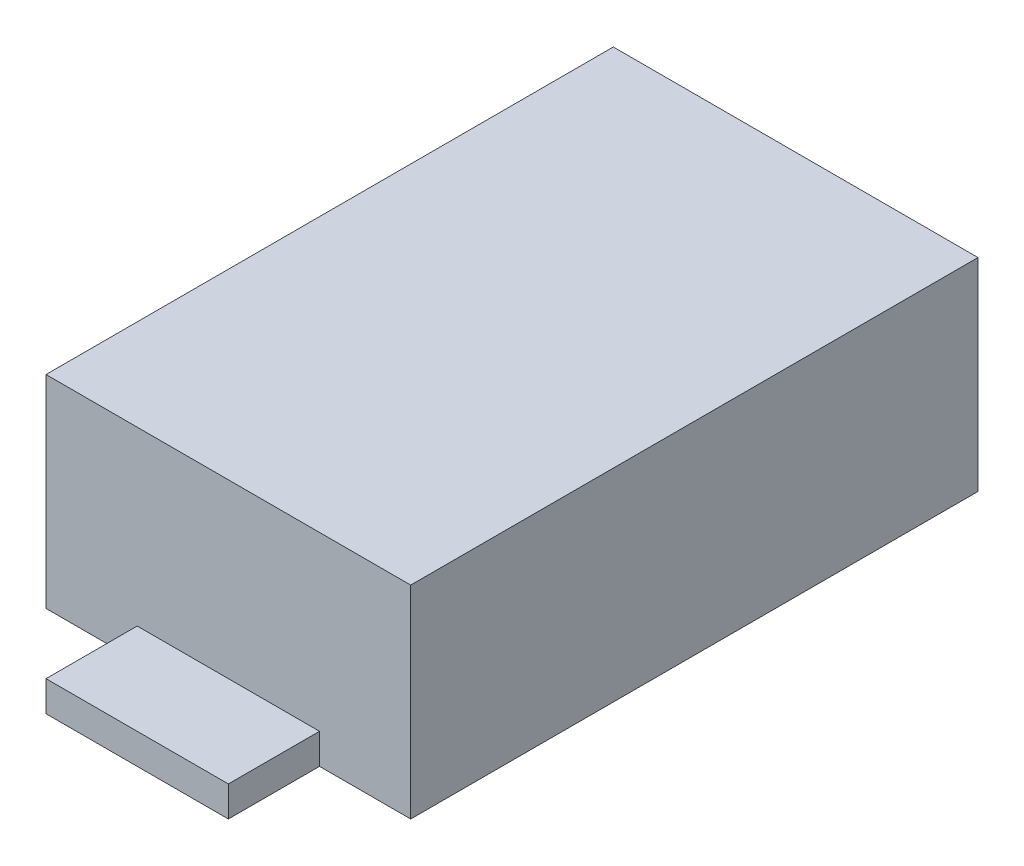
ISO-10303-21;
HEADER;
FILE_DESCRIPTION(('STEP AP214'),'2;1');
FILE_NAME('part.step','',(''),(''),'','','');
FILE_SCHEMA(('AUTOMOTIVE_DESIGN { 1 0 10303 214 1 1 1 1 }'));
ENDSEC;
DATA;
#1=APPLICATION_CONTEXT('core data for automotive mechanical design processes');
#2=APPLICATION_PROTOCOL_DEFINITION('international standard','automotive_design',2000,#1);
#3=PRODUCT_CONTEXT('',#1,'mechanical');
#4=PRODUCT('Part','Part','',(#3));
#5=PRODUCT_RELATED_PRODUCT_CATEGORY('part','',(#4));
#6=PRODUCT_DEFINITION_FORMATION('','',#4);
#7=PRODUCT_DEFINITION_CONTEXT('part definition',#1,'design');
#8=PRODUCT_DEFINITION('design','',#6,#7);
#9=PRODUCT_DEFINITION_SHAPE('','',#8);
#10=(LENGTH_UNIT() NAMED_UNIT(*) SI_UNIT(.MILLI.,.METRE.));
#11=(NAMED_UNIT(*) PLANE_ANGLE_UNIT() SI_UNIT($,.RADIAN.));
#12=(NAMED_UNIT(*) SI_UNIT($,.STERADIAN.) SOLID_ANGLE_UNIT());
#13=UNCERTAINTY_MEASURE_WITH_UNIT(LENGTH_MEASURE(1.E-05),#10,'distance_accuracy_value','');
#14=(GEOMETRIC_REPRESENTATION_CONTEXT(3) GLOBAL_UNCERTAINTY_ASSIGNED_CONTEXT((#13)) GLOBAL_UNIT_ASSIGNED_CONTEXT((#10,
#11,#12)) REPRESENTATION_CONTEXT('',''));
#15=CARTESIAN_POINT('',(0.,0.,0.));
#16=DIRECTION('',(0.,0.,1.));
#17=DIRECTION('',(1.,0.,0.));
#18=AXIS2_PLACEMENT_3D('',#15,#16,#17);
#19=CARTESIAN_POINT('',(-0.9,1.,1.4));
#20=DIRECTION('',(0.,0.,-1.));
#21=DIRECTION('',(-1.,0.,0.));
#22=AXIS2_PLACEMENT_3D('',#19,#20,#21);
#23=PLANE('',#22);
#24=DIRECTION('',(0.,-1.,0.));
#25=VECTOR('',#24,1.);
#26=CARTESIAN_POINT('',(-0.45,0.15,1.4));
#27=LINE('',#26,#25);
#28=CARTESIAN_POINT('',(-0.45,0.15,1.4));
#29=VERTEX_POINT('',#28);
#30=CARTESIAN_POINT('',(-0.45,0.,1.4));
#31=VERTEX_POINT('',#30);
#32=EDGE_CURVE('E153',#29,#31,#27,.T.);
#33=ORIENTED_EDGE('',*,*,#32,.F.);
#34=DIRECTION('',(1.,0.,0.));
#35=VECTOR('',#34,1.);
#36=CARTESIAN_POINT('',(-0.45,0.15,1.4));
#37=LINE('',#36,#35);
#38=CARTESIAN_POINT('',(0.45,0.15,1.4));
#39=VERTEX_POINT('',#38);
#40=EDGE_CURVE('E144',#29,#39,#37,.T.);
#41=ORIENTED_EDGE('',*,*,#40,.T.);
#42=DIRECTION('',(0.,-1.,0.));
#43=VECTOR('',#42,1.);
#44=CARTESIAN_POINT('',(0.45,0.15,1.4));
#45=LINE('',#44,#43);
#46=CARTESIAN_POINT('',(0.45,0.,1.4));
#47=VERTEX_POINT('',#46);
#48=EDGE_CURVE('E159',#39,#47,#45,.T.);
#49=ORIENTED_EDGE('',*,*,#48,.T.);
#50=DIRECTION('',(1.,0.,0.));
#51=VECTOR('',#50,1.);
#52=CARTESIAN_POINT('',(-0.9,0.,1.4));
#53=LINE('',#52,#51);
#54=CARTESIAN_POINT('',(0.9,0.,1.4));
#55=VERTEX_POINT('',#54);
#56=EDGE_CURVE('E204',#47,#55,#53,.T.);
#57=ORIENTED_EDGE('',*,*,#56,.T.);
#58=DIRECTION('',(0.,-1.,0.));
#59=VECTOR('',#58,1.);
#60=CARTESIAN_POINT('',(0.9,1.,1.4));
#61=LINE('',#60,#59);
#62=CARTESIAN_POINT('',(0.9,1.,1.4));
#63=VERTEX_POINT('',#62);
#64=EDGE_CURVE('E195',#63,#55,#61,.T.);
#65=ORIENTED_EDGE('',*,*,#64,.F.);
#66=DIRECTION('',(1.,0.,0.));
#67=VECTOR('',#66,1.);
#68=CARTESIAN_POINT('',(-0.9,1.,1.4));
#69=LINE('',#68,#67);
#70=CARTESIAN_POINT('',(-0.9,1.,1.4));
#71=VERTEX_POINT('',#70);
#72=EDGE_CURVE('E193',#71,#63,#69,.T.);
#73=ORIENTED_EDGE('',*,*,#72,.F.);
#74=DIRECTION('',(0.,-1.,0.));
#75=VECTOR('',#74,1.);
#76=CARTESIAN_POINT('',(-0.9,1.,1.4));
#77=LINE('',#76,#75);
#78=CARTESIAN_POINT('',(-0.9,0.,1.4));
#79=VERTEX_POINT('',#78);
#80=EDGE_CURVE('E209',#71,#79,#77,.T.);
#81=ORIENTED_EDGE('',*,*,#80,.T.);
#82=EDGE_CURVE('E189',#79,#31,#53,.T.);
#83=ORIENTED_EDGE('',*,*,#82,.T.);
#84=EDGE_LOOP('',(#33,#41,#49,#57,#65,#73,#81,#83));
#85=FACE_BOUND('',#84,.T.);
#86=ADVANCED_FACE('F34',(#85),#23,.F.);
#87=CARTESIAN_POINT('',(-0.9,1.,-1.4));
#88=DIRECTION('',(0.,0.,1.));
#89=DIRECTION('',(1.,0.,0.));
#90=AXIS2_PLACEMENT_3D('',#87,#88,#89);
#91=PLANE('',#90);
#92=DIRECTION('',(0.,-1.,0.));
#93=VECTOR('',#92,1.);
#94=CARTESIAN_POINT('',(0.45,0.15,-1.4));
#95=LINE('',#94,#93);
#96=CARTESIAN_POINT('',(0.45,0.15,-1.4));
#97=VERTEX_POINT('',#96);
#98=CARTESIAN_POINT('',(0.45,0.,-1.4));
#99=VERTEX_POINT('',#98);
#100=EDGE_CURVE('E180',#97,#99,#95,.T.);
#101=ORIENTED_EDGE('',*,*,#100,.F.);
#102=DIRECTION('',(1.,0.,0.));
#103=VECTOR('',#102,1.);
#104=CARTESIAN_POINT('',(-0.45,0.15,-1.4));
#105=LINE('',#104,#103);
#106=CARTESIAN_POINT('',(-0.45,0.15,-1.4));
#107=VERTEX_POINT('',#106);
#108=EDGE_CURVE('E164',#107,#97,#105,.T.);
#109=ORIENTED_EDGE('',*,*,#108,.F.);
#110=DIRECTION('',(0.,-1.,0.));
#111=VECTOR('',#110,1.);
#112=CARTESIAN_POINT('',(-0.45,0.15,-1.4));
#113=LINE('',#112,#111);
#114=CARTESIAN_POINT('',(-0.45,0.,-1.4));
#115=VERTEX_POINT('',#114);
#116=EDGE_CURVE('E182',#107,#115,#113,.T.);
#117=ORIENTED_EDGE('',*,*,#116,.T.);
#118=DIRECTION('',(-1.,0.,0.));
#119=VECTOR('',#118,1.);
#120=CARTESIAN_POINT('',(-0.9,0.,-1.4));
#121=LINE('',#120,#119);
#122=CARTESIAN_POINT('',(-0.9,0.,-1.4));
#123=VERTEX_POINT('',#122);
#124=EDGE_CURVE('E198',#115,#123,#121,.T.);
#125=ORIENTED_EDGE('',*,*,#124,.T.);
#126=DIRECTION('',(0.,-1.,0.));
#127=VECTOR('',#126,1.);
#128=CARTESIAN_POINT('',(-0.9,1.,-1.4));
#129=LINE('',#128,#127);
#130=CARTESIAN_POINT('',(-0.9,1.,-1.4));
#131=VERTEX_POINT('',#130);
#132=EDGE_CURVE('E42',#131,#123,#129,.T.);
#133=ORIENTED_EDGE('',*,*,#132,.F.);
#134=DIRECTION('',(-1.,0.,0.));
#135=VECTOR('',#134,1.);
#136=CARTESIAN_POINT('',(-0.9,1.,-1.4));
#137=LINE('',#136,#135);
#138=CARTESIAN_POINT('',(0.9,1.,-1.4));
#139=VERTEX_POINT('',#138);
#140=EDGE_CURVE('E188',#139,#131,#137,.T.);
#141=ORIENTED_EDGE('',*,*,#140,.F.);
#142=DIRECTION('',(0.,-1.,0.));
#143=VECTOR('',#142,1.);
#144=CARTESIAN_POINT('',(0.9,1.,-1.4));
#145=LINE('',#144,#143);
#146=CARTESIAN_POINT('',(0.9,0.,-1.4));
#147=VERTEX_POINT('',#146);
#148=EDGE_CURVE('E11',#139,#147,#145,.T.);
#149=ORIENTED_EDGE('',*,*,#148,.T.);
#150=EDGE_CURVE('E199',#147,#99,#121,.T.);
#151=ORIENTED_EDGE('',*,*,#150,.T.);
#152=EDGE_LOOP('',(#101,#109,#117,#125,#133,#141,#149,#151));
#153=FACE_BOUND('',#152,.T.);
#154=ADVANCED_FACE('F232',(#153),#91,.F.);
#155=CARTESIAN_POINT('',(0.9,1.,-1.4));
#156=DIRECTION('',(-1.,0.,0.));
#157=DIRECTION('',(0.,0.,1.));
#158=AXIS2_PLACEMENT_3D('',#155,#156,#157);
#159=PLANE('',#158);
#160=DIRECTION('',(0.,0.,-1.));
#161=VECTOR('',#160,1.);
#162=CARTESIAN_POINT('',(0.9,0.,-1.4));
#163=LINE('',#162,#161);
#164=EDGE_CURVE('E184',#55,#147,#163,.T.);
#165=ORIENTED_EDGE('',*,*,#164,.T.);
#166=ORIENTED_EDGE('',*,*,#148,.F.);
#167=DIRECTION('',(0.,0.,-1.));
#168=VECTOR('',#167,1.);
#169=CARTESIAN_POINT('',(0.9,1.,-1.4));
#170=LINE('',#169,#168);
#171=EDGE_CURVE('E185',#63,#139,#170,.T.);
#172=ORIENTED_EDGE('',*,*,#171,.F.);
#173=ORIENTED_EDGE('',*,*,#64,.T.);
#174=EDGE_LOOP('',(#165,#166,#172,#173));
#175=FACE_BOUND('',#174,.T.);
#176=ADVANCED_FACE('F36',(#175),#159,.F.);
#177=CARTESIAN_POINT('',(-0.9,1.,-1.4));
#178=DIRECTION('',(1.,0.,0.));
#179=DIRECTION('',(0.,0.,-1.));
#180=AXIS2_PLACEMENT_3D('',#177,#178,#179);
#181=PLANE('',#180);
#182=DIRECTION('',(0.,0.,1.));
#183=VECTOR('',#182,1.);
#184=CARTESIAN_POINT('',(-0.9,0.,-1.4));
#185=LINE('',#184,#183);
#186=EDGE_CURVE('E202',#123,#79,#185,.T.);
#187=ORIENTED_EDGE('',*,*,#186,.T.);
#188=ORIENTED_EDGE('',*,*,#80,.F.);
#189=DIRECTION('',(0.,0.,1.));
#190=VECTOR('',#189,1.);
#191=CARTESIAN_POINT('',(-0.9,1.,-1.4));
#192=LINE('',#191,#190);
#193=EDGE_CURVE('E191',#131,#71,#192,.T.);
#194=ORIENTED_EDGE('',*,*,#193,.F.);
#195=ORIENTED_EDGE('',*,*,#132,.T.);
#196=EDGE_LOOP('',(#187,#188,#194,#195));
#197=FACE_BOUND('',#196,.T.);
#198=ADVANCED_FACE('F216',(#197),#181,.F.);
#199=CARTESIAN_POINT('',(0.,1.,0.));
#200=DIRECTION('',(0.,1.,0.));
#201=DIRECTION('',(0.,0.,1.));
#202=AXIS2_PLACEMENT_3D('',#199,#200,#201);
#203=PLANE('',#202);
#204=ORIENTED_EDGE('',*,*,#171,.T.);
#205=ORIENTED_EDGE('',*,*,#140,.T.);
#206=ORIENTED_EDGE('',*,*,#193,.T.);
#207=ORIENTED_EDGE('',*,*,#72,.T.);
#208=EDGE_LOOP('',(#204,#205,#206,#207));
#209=FACE_BOUND('',#208,.T.);
#210=ADVANCED_FACE('F229',(#209),#203,.T.);
#211=CARTESIAN_POINT('',(0.,0.,0.));
#212=DIRECTION('',(0.,1.,0.));
#213=DIRECTION('',(0.,0.,1.));
#214=AXIS2_PLACEMENT_3D('',#211,#212,#213);
#215=PLANE('',#214);
#216=ORIENTED_EDGE('',*,*,#164,.F.);
#217=ORIENTED_EDGE('',*,*,#56,.F.);
#218=DIRECTION('',(0.,0.,1.));
#219=VECTOR('',#218,1.);
#220=CARTESIAN_POINT('',(0.45,0.,1.4));
#221=LINE('',#220,#219);
#222=CARTESIAN_POINT('',(0.45,0.,1.85));
#223=VERTEX_POINT('',#222);
#224=EDGE_CURVE('E49',#47,#223,#221,.T.);
#225=ORIENTED_EDGE('',*,*,#224,.T.);
#226=DIRECTION('',(-1.,0.,0.));
#227=VECTOR('',#226,1.);
#228=CARTESIAN_POINT('',(-0.45,0.,1.85));
#229=LINE('',#228,#227);
#230=CARTESIAN_POINT('',(-0.45,0.,1.85));
#231=VERTEX_POINT('',#230);
#232=EDGE_CURVE('E155',#223,#231,#229,.T.);
#233=ORIENTED_EDGE('',*,*,#232,.T.);
#234=DIRECTION('',(0.,0.,-1.));
#235=VECTOR('',#234,1.);
#236=CARTESIAN_POINT('',(-0.45,0.,1.4));
#237=LINE('',#236,#235);
#238=EDGE_CURVE('E130',#231,#31,#237,.T.);
#239=ORIENTED_EDGE('',*,*,#238,.T.);
#240=ORIENTED_EDGE('',*,*,#82,.F.);
#241=ORIENTED_EDGE('',*,*,#186,.F.);
#242=ORIENTED_EDGE('',*,*,#124,.F.);
#243=DIRECTION('',(0.,0.,1.));
#244=VECTOR('',#243,1.);
#245=CARTESIAN_POINT('',(-0.45,0.,-1.4));
#246=LINE('',#245,#244);
#247=CARTESIAN_POINT('',(-0.45,0.,-1.85));
#248=VERTEX_POINT('',#247);
#249=EDGE_CURVE('E57',#248,#115,#246,.T.);
#250=ORIENTED_EDGE('',*,*,#249,.F.);
#251=DIRECTION('',(-1.,0.,0.));
#252=VECTOR('',#251,1.);
#253=CARTESIAN_POINT('',(-0.45,0.,-1.85));
#254=LINE('',#253,#252);
#255=CARTESIAN_POINT('',(0.45,0.,-1.85));
#256=VERTEX_POINT('',#255);
#257=EDGE_CURVE('E165',#256,#248,#254,.T.);
#258=ORIENTED_EDGE('',*,*,#257,.F.);
#259=DIRECTION('',(0.,0.,-1.));
#260=VECTOR('',#259,1.);
#261=CARTESIAN_POINT('',(0.45,0.,-1.4));
#262=LINE('',#261,#260);
#263=EDGE_CURVE('E173',#99,#256,#262,.T.);
#264=ORIENTED_EDGE('',*,*,#263,.F.);
#265=ORIENTED_EDGE('',*,*,#150,.F.);
#266=EDGE_LOOP('',(#216,#217,#225,#233,#239,#240,#241,#242,#250,#258,#264,#265));
#267=FACE_BOUND('',#266,.T.);
#268=ADVANCED_FACE('F223',(#267),#215,.F.);
#269=CARTESIAN_POINT('',(-0.45,0.15,-1.4));
#270=DIRECTION('',(1.,0.,0.));
#271=DIRECTION('',(0.,0.,-1.));
#272=AXIS2_PLACEMENT_3D('',#269,#270,#271);
#273=PLANE('',#272);
#274=ORIENTED_EDGE('',*,*,#249,.T.);
#275=ORIENTED_EDGE('',*,*,#116,.F.);
#276=DIRECTION('',(0.,0.,1.));
#277=VECTOR('',#276,1.);
#278=CARTESIAN_POINT('',(-0.45,0.15,-1.4));
#279=LINE('',#278,#277);
#280=CARTESIAN_POINT('',(-0.45,0.15,-1.85));
#281=VERTEX_POINT('',#280);
#282=EDGE_CURVE('E162',#281,#107,#279,.T.);
#283=ORIENTED_EDGE('',*,*,#282,.F.);
#284=DIRECTION('',(0.,-1.,0.));
#285=VECTOR('',#284,1.);
#286=CARTESIAN_POINT('',(-0.45,0.15,-1.85));
#287=LINE('',#286,#285);
#288=EDGE_CURVE('E171',#281,#248,#287,.T.);
#289=ORIENTED_EDGE('',*,*,#288,.T.);
#290=EDGE_LOOP('',(#274,#275,#283,#289));
#291=FACE_BOUND('',#290,.T.);
#292=ADVANCED_FACE('F249',(#291),#273,.F.);
#293=CARTESIAN_POINT('',(0.45,0.15,-1.4));
#294=DIRECTION('',(-1.,0.,0.));
#295=DIRECTION('',(0.,0.,1.));
#296=AXIS2_PLACEMENT_3D('',#293,#294,#295);
#297=PLANE('',#296);
#298=ORIENTED_EDGE('',*,*,#263,.T.);
#299=DIRECTION('',(0.,-1.,0.));
#300=VECTOR('',#299,1.);
#301=CARTESIAN_POINT('',(0.45,0.15,-1.85));
#302=LINE('',#301,#300);
#303=CARTESIAN_POINT('',(0.45,0.15,-1.85));
#304=VERTEX_POINT('',#303);
#305=EDGE_CURVE('E177',#304,#256,#302,.T.);
#306=ORIENTED_EDGE('',*,*,#305,.F.);
#307=DIRECTION('',(0.,0.,-1.));
#308=VECTOR('',#307,1.);
#309=CARTESIAN_POINT('',(0.45,0.15,-1.4));
#310=LINE('',#309,#308);
#311=EDGE_CURVE('E167',#97,#304,#310,.T.);
#312=ORIENTED_EDGE('',*,*,#311,.F.);
#313=ORIENTED_EDGE('',*,*,#100,.T.);
#314=EDGE_LOOP('',(#298,#306,#312,#313));
#315=FACE_BOUND('',#314,.T.);
#316=ADVANCED_FACE('F239',(#315),#297,.F.);
#317=CARTESIAN_POINT('',(-0.45,0.15,-1.85));
#318=DIRECTION('',(0.,0.,1.));
#319=DIRECTION('',(1.,0.,0.));
#320=AXIS2_PLACEMENT_3D('',#317,#318,#319);
#321=PLANE('',#320);
#322=ORIENTED_EDGE('',*,*,#257,.T.);
#323=ORIENTED_EDGE('',*,*,#288,.F.);
#324=DIRECTION('',(-1.,0.,0.));
#325=VECTOR('',#324,1.);
#326=CARTESIAN_POINT('',(-0.45,0.15,-1.85));
#327=LINE('',#326,#325);
#328=EDGE_CURVE('E169',#304,#281,#327,.T.);
#329=ORIENTED_EDGE('',*,*,#328,.F.);
#330=ORIENTED_EDGE('',*,*,#305,.T.);
#331=EDGE_LOOP('',(#322,#323,#329,#330));
#332=FACE_BOUND('',#331,.T.);
#333=ADVANCED_FACE('F243',(#332),#321,.F.);
#334=CARTESIAN_POINT('',(0.,0.15,0.));
#335=DIRECTION('',(0.,-1.,0.));
#336=DIRECTION('',(0.,0.,-1.));
#337=AXIS2_PLACEMENT_3D('',#334,#335,#336);
#338=PLANE('',#337);
#339=ORIENTED_EDGE('',*,*,#282,.T.);
#340=ORIENTED_EDGE('',*,*,#108,.T.);
#341=ORIENTED_EDGE('',*,*,#311,.T.);
#342=ORIENTED_EDGE('',*,*,#328,.T.);
#343=EDGE_LOOP('',(#339,#340,#341,#342));
#344=FACE_BOUND('',#343,.T.);
#345=ADVANCED_FACE('F247',(#344),#338,.F.);
#346=CARTESIAN_POINT('',(-0.45,0.15,1.4));
#347=DIRECTION('',(-1.,0.,0.));
#348=DIRECTION('',(0.,0.,1.));
#349=AXIS2_PLACEMENT_3D('',#346,#347,#348);
#350=PLANE('',#349);
#351=ORIENTED_EDGE('',*,*,#238,.F.);
#352=DIRECTION('',(0.,-1.,0.));
#353=VECTOR('',#352,1.);
#354=CARTESIAN_POINT('',(-0.45,0.15,1.85));
#355=LINE('',#354,#353);
#356=CARTESIAN_POINT('',(-0.45,0.15,1.85));
#357=VERTEX_POINT('',#356);
#358=EDGE_CURVE('E124',#357,#231,#355,.T.);
#359=ORIENTED_EDGE('',*,*,#358,.F.);
#360=DIRECTION('',(0.,0.,-1.));
#361=VECTOR('',#360,1.);
#362=CARTESIAN_POINT('',(-0.45,0.15,1.4));
#363=LINE('',#362,#361);
#364=EDGE_CURVE('E127',#357,#29,#363,.T.);
#365=ORIENTED_EDGE('',*,*,#364,.T.);
#366=ORIENTED_EDGE('',*,*,#32,.T.);
#367=EDGE_LOOP('',(#351,#359,#365,#366));
#368=FACE_BOUND('',#367,.T.);
#369=ADVANCED_FACE('F126',(#368),#350,.T.);
#370=CARTESIAN_POINT('',(-0.45,0.15,1.85));
#371=DIRECTION('',(0.,0.,1.));
#372=DIRECTION('',(1.,0.,0.));
#373=AXIS2_PLACEMENT_3D('',#370,#371,#372);
#374=PLANE('',#373);
#375=ORIENTED_EDGE('',*,*,#232,.F.);
#376=DIRECTION('',(0.,-1.,0.));
#377=VECTOR('',#376,1.);
#378=CARTESIAN_POINT('',(0.45,0.15,1.85));
#379=LINE('',#378,#377);
#380=CARTESIAN_POINT('',(0.45,0.15,1.85));
#381=VERTEX_POINT('',#380);
#382=EDGE_CURVE('E135',#381,#223,#379,.T.);
#383=ORIENTED_EDGE('',*,*,#382,.F.);
#384=DIRECTION('',(-1.,0.,0.));
#385=VECTOR('',#384,1.);
#386=CARTESIAN_POINT('',(-0.45,0.15,1.85));
#387=LINE('',#386,#385);
#388=EDGE_CURVE('E141',#381,#357,#387,.T.);
#389=ORIENTED_EDGE('',*,*,#388,.T.);
#390=ORIENTED_EDGE('',*,*,#358,.T.);
#391=EDGE_LOOP('',(#375,#383,#389,#390));
#392=FACE_BOUND('',#391,.T.);
#393=ADVANCED_FACE('F147',(#392),#374,.T.);
#394=CARTESIAN_POINT('',(0.45,0.15,1.4));
#395=DIRECTION('',(1.,0.,0.));
#396=DIRECTION('',(0.,0.,-1.));
#397=AXIS2_PLACEMENT_3D('',#394,#395,#396);
#398=PLANE('',#397);
#399=ORIENTED_EDGE('',*,*,#224,.F.);
#400=ORIENTED_EDGE('',*,*,#48,.F.);
#401=DIRECTION('',(0.,0.,1.));
#402=VECTOR('',#401,1.);
#403=CARTESIAN_POINT('',(0.45,0.15,1.4));
#404=LINE('',#403,#402);
#405=EDGE_CURVE('E148',#39,#381,#404,.T.);
#406=ORIENTED_EDGE('',*,*,#405,.T.);
#407=ORIENTED_EDGE('',*,*,#382,.T.);
#408=EDGE_LOOP('',(#399,#400,#406,#407));
#409=FACE_BOUND('',#408,.T.);
#410=ADVANCED_FACE('F338',(#409),#398,.T.);
#411=CARTESIAN_POINT('',(0.,0.15,0.));
#412=DIRECTION('',(0.,-1.,0.));
#413=DIRECTION('',(0.,0.,1.));
#414=AXIS2_PLACEMENT_3D('',#411,#412,#413);
#415=PLANE('',#414);
#416=ORIENTED_EDGE('',*,*,#364,.F.);
#417=ORIENTED_EDGE('',*,*,#388,.F.);
#418=ORIENTED_EDGE('',*,*,#405,.F.);
#419=ORIENTED_EDGE('',*,*,#40,.F.);
#420=EDGE_LOOP('',(#416,#417,#418,#419));
#421=FACE_BOUND('',#420,.T.);
#422=ADVANCED_FACE('F139',(#421),#415,.F.);
#423=CLOSED_SHELL('',(#86,#154,#176,#198,#210,#268,#292,#316,#333,#345,#369,#393,#410,#422));
#424=MANIFOLD_SOLID_BREP('B2',#423);
#425=ADVANCED_BREP_SHAPE_REPRESENTATION('',(#18,#424),#14);
#426=SHAPE_DEFINITION_REPRESENTATION(#9,#425);
ENDSEC;
END-ISO-10303-21;
